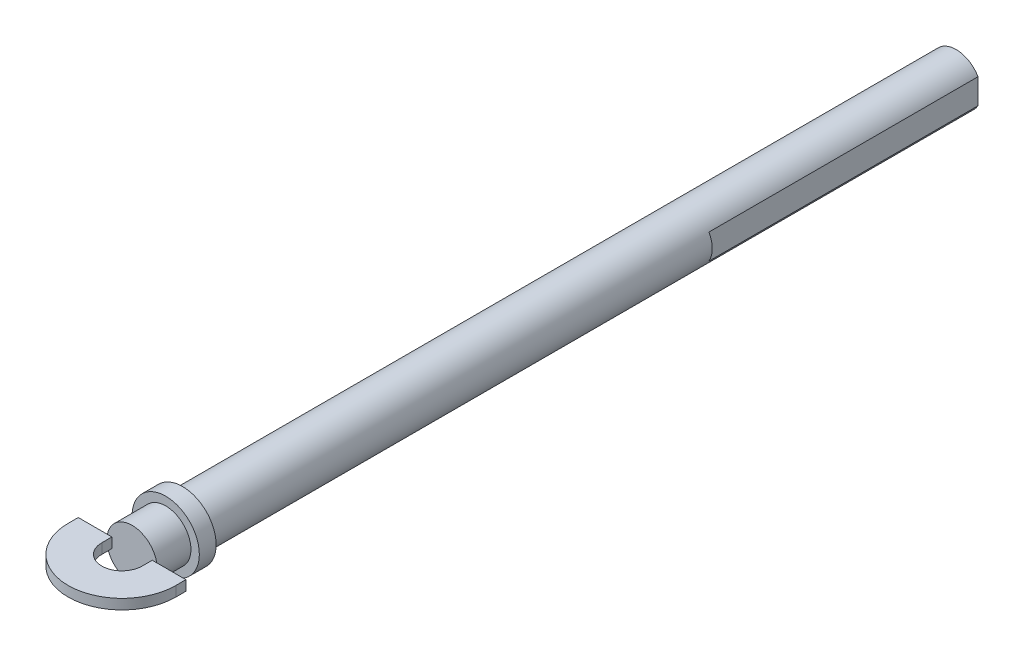
ISO-10303-21;
HEADER;
FILE_DESCRIPTION(('STEP AP214'),'2;1');
FILE_NAME('part.step','',(''),(''),'','','');
FILE_SCHEMA(('AUTOMOTIVE_DESIGN { 1 0 10303 214 1 1 1 1 }'));
ENDSEC;
DATA;
#1=APPLICATION_CONTEXT('core data for automotive mechanical design processes');
#2=APPLICATION_PROTOCOL_DEFINITION('international standard','automotive_design',2000,#1);
#3=PRODUCT_CONTEXT('',#1,'mechanical');
#4=PRODUCT('Part','Part','',(#3));
#5=PRODUCT_RELATED_PRODUCT_CATEGORY('part','',(#4));
#6=PRODUCT_DEFINITION_FORMATION('','',#4);
#7=PRODUCT_DEFINITION_CONTEXT('part definition',#1,'design');
#8=PRODUCT_DEFINITION('design','',#6,#7);
#9=PRODUCT_DEFINITION_SHAPE('','',#8);
#10=(LENGTH_UNIT() NAMED_UNIT(*) SI_UNIT(.MILLI.,.METRE.));
#11=(NAMED_UNIT(*) PLANE_ANGLE_UNIT() SI_UNIT($,.RADIAN.));
#12=(NAMED_UNIT(*) SI_UNIT($,.STERADIAN.) SOLID_ANGLE_UNIT());
#13=UNCERTAINTY_MEASURE_WITH_UNIT(LENGTH_MEASURE(1.E-05),#10,'distance_accuracy_value','');
#14=(GEOMETRIC_REPRESENTATION_CONTEXT(3) GLOBAL_UNCERTAINTY_ASSIGNED_CONTEXT((#13)) GLOBAL_UNIT_ASSIGNED_CONTEXT((#10,
#11,#12)) REPRESENTATION_CONTEXT('',''));
#15=CARTESIAN_POINT('',(0.,0.,0.));
#16=DIRECTION('',(0.,0.,1.));
#17=DIRECTION('',(1.,0.,0.));
#18=AXIS2_PLACEMENT_3D('',#15,#16,#17);
#19=CARTESIAN_POINT('',(0.,0.,230.));
#20=DIRECTION('',(0.,0.,-1.));
#21=DIRECTION('',(-1.,0.,0.));
#22=AXIS2_PLACEMENT_3D('',#19,#20,#21);
#23=CYLINDRICAL_SURFACE('',#22,7.5);
#24=CARTESIAN_POINT('',(0.,0.,230.));
#25=DIRECTION('',(0.,0.,1.));
#26=DIRECTION('',(1.,0.,0.));
#27=AXIS2_PLACEMENT_3D('',#24,#25,#26);
#28=CIRCLE('',#27,7.5);
#29=CARTESIAN_POINT('',(7.5,0.,230.));
#30=VERTEX_POINT('',#29);
#31=EDGE_CURVE('E197',#30,#30,#28,.T.);
#32=ORIENTED_EDGE('',*,*,#31,.F.);
#33=EDGE_LOOP('',(#32));
#34=FACE_BOUND('',#33,.T.);
#35=CARTESIAN_POINT('',(0.,0.,80.));
#36=DIRECTION('',(0.,0.,-1.));
#37=DIRECTION('',(-1.,0.,0.));
#38=AXIS2_PLACEMENT_3D('',#35,#36,#37);
#39=CIRCLE('',#38,7.5);
#40=CARTESIAN_POINT('',(6.5,3.74165738677394,80.));
#41=VERTEX_POINT('',#40);
#42=CARTESIAN_POINT('',(6.5,-3.74165738677394,80.));
#43=VERTEX_POINT('',#42);
#44=EDGE_CURVE('E168',#41,#43,#39,.T.);
#45=ORIENTED_EDGE('',*,*,#44,.F.);
#46=DIRECTION('',(0.,0.,-1.));
#47=VECTOR('',#46,1.);
#48=CARTESIAN_POINT('',(6.5,3.74165738677394,80.));
#49=LINE('',#48,#47);
#50=CARTESIAN_POINT('',(6.5,3.74165738677394,0.));
#51=VERTEX_POINT('',#50);
#52=EDGE_CURVE('E177',#41,#51,#49,.T.);
#53=ORIENTED_EDGE('',*,*,#52,.T.);
#54=CARTESIAN_POINT('',(0.,0.,0.));
#55=DIRECTION('',(0.,0.,1.));
#56=DIRECTION('',(1.,0.,0.));
#57=AXIS2_PLACEMENT_3D('',#54,#55,#56);
#58=CIRCLE('',#57,7.5);
#59=CARTESIAN_POINT('',(-6.5,3.74165738677394,0.));
#60=VERTEX_POINT('',#59);
#61=EDGE_CURVE('E206',#51,#60,#58,.T.);
#62=ORIENTED_EDGE('',*,*,#61,.T.);
#63=DIRECTION('',(0.,0.,-1.));
#64=VECTOR('',#63,1.);
#65=CARTESIAN_POINT('',(-6.5,3.74165738677394,80.));
#66=LINE('',#65,#64);
#67=CARTESIAN_POINT('',(-6.5,3.74165738677394,80.));
#68=VERTEX_POINT('',#67);
#69=EDGE_CURVE('E184',#68,#60,#66,.T.);
#70=ORIENTED_EDGE('',*,*,#69,.F.);
#71=CARTESIAN_POINT('',(0.,0.,80.));
#72=DIRECTION('',(0.,0.,-1.));
#73=DIRECTION('',(-1.,0.,0.));
#74=AXIS2_PLACEMENT_3D('',#71,#72,#73);
#75=CIRCLE('',#74,7.5);
#76=CARTESIAN_POINT('',(-6.5,-3.74165738677394,80.));
#77=VERTEX_POINT('',#76);
#78=EDGE_CURVE('E162',#77,#68,#75,.T.);
#79=ORIENTED_EDGE('',*,*,#78,.F.);
#80=DIRECTION('',(0.,0.,-1.));
#81=VECTOR('',#80,1.);
#82=CARTESIAN_POINT('',(-6.5,-3.74165738677394,80.));
#83=LINE('',#82,#81);
#84=CARTESIAN_POINT('',(-6.5,-3.74165738677394,0.));
#85=VERTEX_POINT('',#84);
#86=EDGE_CURVE('E176',#77,#85,#83,.T.);
#87=ORIENTED_EDGE('',*,*,#86,.T.);
#88=CARTESIAN_POINT('',(6.5,-3.74165738677394,0.));
#89=VERTEX_POINT('',#88);
#90=EDGE_CURVE('E201',#85,#89,#58,.T.);
#91=ORIENTED_EDGE('',*,*,#90,.T.);
#92=DIRECTION('',(0.,0.,-1.));
#93=VECTOR('',#92,1.);
#94=CARTESIAN_POINT('',(6.5,-3.74165738677394,80.));
#95=LINE('',#94,#93);
#96=EDGE_CURVE('E174',#43,#89,#95,.T.);
#97=ORIENTED_EDGE('',*,*,#96,.F.);
#98=EDGE_LOOP('',(#45,#53,#62,#70,#79,#87,#91,#97));
#99=FACE_BOUND('',#98,.T.);
#100=ADVANCED_FACE('F33',(#34,#99),#23,.T.);
#101=CARTESIAN_POINT('',(0.,0.,0.));
#102=DIRECTION('',(0.,0.,1.));
#103=DIRECTION('',(1.,0.,0.));
#104=AXIS2_PLACEMENT_3D('',#101,#102,#103);
#105=PLANE('',#104);
#106=ORIENTED_EDGE('',*,*,#61,.F.);
#107=DIRECTION('',(0.,1.,0.));
#108=VECTOR('',#107,1.);
#109=CARTESIAN_POINT('',(6.5,3.74165738677394,0.));
#110=LINE('',#109,#108);
#111=EDGE_CURVE('E171',#89,#51,#110,.T.);
#112=ORIENTED_EDGE('',*,*,#111,.F.);
#113=ORIENTED_EDGE('',*,*,#90,.F.);
#114=DIRECTION('',(0.,-1.,0.));
#115=VECTOR('',#114,1.);
#116=CARTESIAN_POINT('',(-6.5,3.74165738677394,0.));
#117=LINE('',#116,#115);
#118=EDGE_CURVE('E159',#60,#85,#117,.T.);
#119=ORIENTED_EDGE('',*,*,#118,.F.);
#120=EDGE_LOOP('',(#106,#112,#113,#119));
#121=FACE_BOUND('',#120,.T.);
#122=ADVANCED_FACE('F294',(#121),#105,.F.);
#123=CARTESIAN_POINT('',(0.,0.,235.));
#124=DIRECTION('',(0.,0.,-1.));
#125=DIRECTION('',(-1.,0.,0.));
#126=AXIS2_PLACEMENT_3D('',#123,#124,#125);
#127=CYLINDRICAL_SURFACE('',#126,10.);
#128=CARTESIAN_POINT('',(0.,0.,235.));
#129=DIRECTION('',(0.,0.,1.));
#130=DIRECTION('',(1.,0.,0.));
#131=AXIS2_PLACEMENT_3D('',#128,#129,#130);
#132=CIRCLE('',#131,10.);
#133=CARTESIAN_POINT('',(10.,0.,235.));
#134=VERTEX_POINT('',#133);
#135=EDGE_CURVE('E198',#134,#134,#132,.T.);
#136=ORIENTED_EDGE('',*,*,#135,.F.);
#137=EDGE_LOOP('',(#136));
#138=FACE_BOUND('',#137,.T.);
#139=CARTESIAN_POINT('',(0.,0.,230.));
#140=DIRECTION('',(0.,0.,1.));
#141=DIRECTION('',(1.,0.,0.));
#142=AXIS2_PLACEMENT_3D('',#139,#140,#141);
#143=CIRCLE('',#142,10.);
#144=CARTESIAN_POINT('',(10.,0.,230.));
#145=VERTEX_POINT('',#144);
#146=EDGE_CURVE('E192',#145,#145,#143,.T.);
#147=ORIENTED_EDGE('',*,*,#146,.T.);
#148=EDGE_LOOP('',(#147));
#149=FACE_BOUND('',#148,.T.);
#150=ADVANCED_FACE('F299',(#138,#149),#127,.T.);
#151=CARTESIAN_POINT('',(0.,0.,235.));
#152=DIRECTION('',(0.,0.,1.));
#153=DIRECTION('',(1.,0.,0.));
#154=AXIS2_PLACEMENT_3D('',#151,#152,#153);
#155=PLANE('',#154);
#156=CARTESIAN_POINT('',(0.,0.,235.));
#157=DIRECTION('',(0.,0.,1.));
#158=DIRECTION('',(1.,0.,0.));
#159=AXIS2_PLACEMENT_3D('',#156,#157,#158);
#160=CIRCLE('',#159,7.5);
#161=CARTESIAN_POINT('',(7.5,0.,235.));
#162=VERTEX_POINT('',#161);
#163=EDGE_CURVE('E194',#162,#162,#160,.T.);
#164=ORIENTED_EDGE('',*,*,#163,.F.);
#165=EDGE_LOOP('',(#164));
#166=FACE_BOUND('',#165,.T.);
#167=ORIENTED_EDGE('',*,*,#135,.T.);
#168=EDGE_LOOP('',(#167));
#169=FACE_BOUND('',#168,.T.);
#170=ADVANCED_FACE('F337',(#166,#169),#155,.T.);
#171=CARTESIAN_POINT('',(0.,0.,230.));
#172=DIRECTION('',(0.,0.,1.));
#173=DIRECTION('',(1.,0.,0.));
#174=AXIS2_PLACEMENT_3D('',#171,#172,#173);
#175=PLANE('',#174);
#176=ORIENTED_EDGE('',*,*,#31,.T.);
#177=EDGE_LOOP('',(#176));
#178=FACE_BOUND('',#177,.T.);
#179=ORIENTED_EDGE('',*,*,#146,.F.);
#180=EDGE_LOOP('',(#179));
#181=FACE_BOUND('',#180,.T.);
#182=ADVANCED_FACE('F336',(#178,#181),#175,.F.);
#183=CARTESIAN_POINT('',(0.,0.,245.));
#184=DIRECTION('',(0.,0.,-1.));
#185=DIRECTION('',(-1.,0.,0.));
#186=AXIS2_PLACEMENT_3D('',#183,#184,#185);
#187=CYLINDRICAL_SURFACE('',#186,7.5);
#188=CARTESIAN_POINT('',(0.,0.,245.));
#189=DIRECTION('',(0.,0.,1.));
#190=DIRECTION('',(1.,0.,0.));
#191=AXIS2_PLACEMENT_3D('',#188,#189,#190);
#192=CIRCLE('',#191,7.5);
#193=CARTESIAN_POINT('',(7.34846922834953,1.5,245.));
#194=VERTEX_POINT('',#193);
#195=CARTESIAN_POINT('',(-7.34846922834953,1.5,245.));
#196=VERTEX_POINT('',#195);
#197=EDGE_CURVE('E189',#194,#196,#192,.T.);
#198=ORIENTED_EDGE('',*,*,#197,.F.);
#199=CARTESIAN_POINT('',(7.34846922834953,-1.5,245.));
#200=VERTEX_POINT('',#199);
#201=EDGE_CURVE('E141',#200,#194,#192,.T.);
#202=ORIENTED_EDGE('',*,*,#201,.F.);
#203=CARTESIAN_POINT('',(-7.34846922834953,-1.5,245.));
#204=VERTEX_POINT('',#203);
#205=EDGE_CURVE('E215',#204,#200,#192,.T.);
#206=ORIENTED_EDGE('',*,*,#205,.F.);
#207=EDGE_CURVE('E193',#196,#204,#192,.T.);
#208=ORIENTED_EDGE('',*,*,#207,.F.);
#209=EDGE_LOOP('',(#198,#202,#206,#208));
#210=FACE_BOUND('',#209,.T.);
#211=ORIENTED_EDGE('',*,*,#163,.T.);
#212=EDGE_LOOP('',(#211));
#213=FACE_BOUND('',#212,.T.);
#214=ADVANCED_FACE('F223',(#210,#213),#187,.T.);
#215=CARTESIAN_POINT('',(0.,0.,245.));
#216=DIRECTION('',(0.,0.,1.));
#217=DIRECTION('',(1.,0.,0.));
#218=AXIS2_PLACEMENT_3D('',#215,#216,#217);
#219=PLANE('',#218);
#220=DIRECTION('',(1.,0.,0.));
#221=VECTOR('',#220,1.);
#222=CARTESIAN_POINT('',(6.,1.5,245.));
#223=LINE('',#222,#221);
#224=CARTESIAN_POINT('',(6.,1.5,245.));
#225=VERTEX_POINT('',#224);
#226=EDGE_CURVE('E144',#225,#194,#223,.T.);
#227=ORIENTED_EDGE('',*,*,#226,.T.);
#228=ORIENTED_EDGE('',*,*,#197,.T.);
#229=DIRECTION('',(-1.,0.,0.));
#230=VECTOR('',#229,1.);
#231=CARTESIAN_POINT('',(0.,1.5,245.));
#232=LINE('',#231,#230);
#233=CARTESIAN_POINT('',(-6.,1.5,245.));
#234=VERTEX_POINT('',#233);
#235=EDGE_CURVE('E11',#234,#196,#232,.T.);
#236=ORIENTED_EDGE('',*,*,#235,.F.);
#237=DIRECTION('',(0.,-1.,0.));
#238=VECTOR('',#237,1.);
#239=CARTESIAN_POINT('',(-6.,1.5,245.));
#240=LINE('',#239,#238);
#241=CARTESIAN_POINT('',(-6.,-1.5,245.));
#242=VERTEX_POINT('',#241);
#243=EDGE_CURVE('E217',#234,#242,#240,.T.);
#244=ORIENTED_EDGE('',*,*,#243,.T.);
#245=DIRECTION('',(-1.,0.,0.));
#246=VECTOR('',#245,1.);
#247=CARTESIAN_POINT('',(0.,-1.5,245.));
#248=LINE('',#247,#246);
#249=EDGE_CURVE('E40',#242,#204,#248,.T.);
#250=ORIENTED_EDGE('',*,*,#249,.T.);
#251=ORIENTED_EDGE('',*,*,#205,.T.);
#252=DIRECTION('',(1.,0.,0.));
#253=VECTOR('',#252,1.);
#254=CARTESIAN_POINT('',(6.,-1.5,245.));
#255=LINE('',#254,#253);
#256=CARTESIAN_POINT('',(6.,-1.5,245.));
#257=VERTEX_POINT('',#256);
#258=EDGE_CURVE('E245',#257,#200,#255,.T.);
#259=ORIENTED_EDGE('',*,*,#258,.F.);
#260=DIRECTION('',(0.,-1.,0.));
#261=VECTOR('',#260,1.);
#262=CARTESIAN_POINT('',(6.,1.5,245.));
#263=LINE('',#262,#261);
#264=EDGE_CURVE('E160',#225,#257,#263,.T.);
#265=ORIENTED_EDGE('',*,*,#264,.F.);
#266=EDGE_LOOP('',(#227,#228,#236,#244,#250,#251,#259,#265));
#267=FACE_BOUND('',#266,.T.);
#268=ADVANCED_FACE('F213',(#267),#219,.T.);
#269=CARTESIAN_POINT('',(-6.5,3.74165738677394,80.));
#270=DIRECTION('',(1.,0.,0.));
#271=DIRECTION('',(0.,0.,-1.));
#272=AXIS2_PLACEMENT_3D('',#269,#270,#271);
#273=PLANE('',#272);
#274=ORIENTED_EDGE('',*,*,#118,.T.);
#275=ORIENTED_EDGE('',*,*,#86,.F.);
#276=DIRECTION('',(0.,-1.,0.));
#277=VECTOR('',#276,1.);
#278=CARTESIAN_POINT('',(-6.5,3.74165738677394,80.));
#279=LINE('',#278,#277);
#280=EDGE_CURVE('E182',#68,#77,#279,.T.);
#281=ORIENTED_EDGE('',*,*,#280,.F.);
#282=ORIENTED_EDGE('',*,*,#69,.T.);
#283=EDGE_LOOP('',(#274,#275,#281,#282));
#284=FACE_BOUND('',#283,.T.);
#285=ADVANCED_FACE('F319',(#284),#273,.F.);
#286=CARTESIAN_POINT('',(0.,0.,80.));
#287=DIRECTION('',(0.,0.,-1.));
#288=DIRECTION('',(-1.,0.,0.));
#289=AXIS2_PLACEMENT_3D('',#286,#287,#288);
#290=PLANE('',#289);
#291=ORIENTED_EDGE('',*,*,#78,.T.);
#292=ORIENTED_EDGE('',*,*,#280,.T.);
#293=EDGE_LOOP('',(#291,#292));
#294=FACE_BOUND('',#293,.T.);
#295=ADVANCED_FACE('F321',(#294),#290,.T.);
#296=CARTESIAN_POINT('',(6.5,3.74165738677394,80.));
#297=DIRECTION('',(-1.,0.,0.));
#298=DIRECTION('',(0.,0.,1.));
#299=AXIS2_PLACEMENT_3D('',#296,#297,#298);
#300=PLANE('',#299);
#301=ORIENTED_EDGE('',*,*,#111,.T.);
#302=ORIENTED_EDGE('',*,*,#52,.F.);
#303=DIRECTION('',(0.,1.,0.));
#304=VECTOR('',#303,1.);
#305=CARTESIAN_POINT('',(6.5,3.74165738677394,80.));
#306=LINE('',#305,#304);
#307=EDGE_CURVE('E170',#43,#41,#306,.T.);
#308=ORIENTED_EDGE('',*,*,#307,.F.);
#309=ORIENTED_EDGE('',*,*,#96,.T.);
#310=EDGE_LOOP('',(#301,#302,#308,#309));
#311=FACE_BOUND('',#310,.T.);
#312=ADVANCED_FACE('F311',(#311),#300,.F.);
#313=CARTESIAN_POINT('',(0.,0.,80.));
#314=DIRECTION('',(0.,0.,-1.));
#315=DIRECTION('',(-1.,0.,0.));
#316=AXIS2_PLACEMENT_3D('',#313,#314,#315);
#317=PLANE('',#316);
#318=ORIENTED_EDGE('',*,*,#44,.T.);
#319=ORIENTED_EDGE('',*,*,#307,.T.);
#320=EDGE_LOOP('',(#318,#319));
#321=FACE_BOUND('',#320,.T.);
#322=ADVANCED_FACE('F309',(#321),#317,.T.);
#323=CARTESIAN_POINT('',(16.,1.5,248.));
#324=DIRECTION('',(-1.,0.,0.));
#325=DIRECTION('',(0.,0.,1.));
#326=AXIS2_PLACEMENT_3D('',#323,#324,#325);
#327=PLANE('',#326);
#328=DIRECTION('',(0.,0.,-1.));
#329=VECTOR('',#328,1.);
#330=CARTESIAN_POINT('',(16.,-1.5,248.));
#331=LINE('',#330,#329);
#332=CARTESIAN_POINT('',(16.,-1.5,248.));
#333=VERTEX_POINT('',#332);
#334=CARTESIAN_POINT('',(16.,-1.5,245.));
#335=VERTEX_POINT('',#334);
#336=EDGE_CURVE('E158',#333,#335,#331,.T.);
#337=ORIENTED_EDGE('',*,*,#336,.T.);
#338=DIRECTION('',(0.,-1.,0.));
#339=VECTOR('',#338,1.);
#340=CARTESIAN_POINT('',(16.,1.5,245.));
#341=LINE('',#340,#339);
#342=CARTESIAN_POINT('',(16.,1.5,245.));
#343=VERTEX_POINT('',#342);
#344=EDGE_CURVE('E138',#343,#335,#341,.T.);
#345=ORIENTED_EDGE('',*,*,#344,.F.);
#346=DIRECTION('',(0.,0.,-1.));
#347=VECTOR('',#346,1.);
#348=CARTESIAN_POINT('',(16.,1.5,248.));
#349=LINE('',#348,#347);
#350=CARTESIAN_POINT('',(16.,1.5,248.));
#351=VERTEX_POINT('',#350);
#352=EDGE_CURVE('E145',#351,#343,#349,.T.);
#353=ORIENTED_EDGE('',*,*,#352,.F.);
#354=DIRECTION('',(0.,-1.,0.));
#355=VECTOR('',#354,1.);
#356=CARTESIAN_POINT('',(16.,1.5,248.));
#357=LINE('',#356,#355);
#358=EDGE_CURVE('E242',#351,#333,#357,.T.);
#359=ORIENTED_EDGE('',*,*,#358,.T.);
#360=EDGE_LOOP('',(#337,#345,#353,#359));
#361=FACE_BOUND('',#360,.T.);
#362=ADVANCED_FACE('F156',(#361),#327,.F.);
#363=CARTESIAN_POINT('',(6.,1.5,245.));
#364=DIRECTION('',(0.,0.,-1.));
#365=DIRECTION('',(-1.,0.,0.));
#366=AXIS2_PLACEMENT_3D('',#363,#364,#365);
#367=PLANE('',#366);
#368=ORIENTED_EDGE('',*,*,#201,.T.);
#369=EDGE_CURVE('E134',#194,#343,#223,.T.);
#370=ORIENTED_EDGE('',*,*,#369,.T.);
#371=ORIENTED_EDGE('',*,*,#344,.T.);
#372=EDGE_CURVE('E244',#200,#335,#255,.T.);
#373=ORIENTED_EDGE('',*,*,#372,.F.);
#374=EDGE_LOOP('',(#368,#370,#371,#373));
#375=FACE_BOUND('',#374,.T.);
#376=ADVANCED_FACE('F136',(#375),#367,.T.);
#377=CARTESIAN_POINT('',(6.,1.5,248.));
#378=DIRECTION('',(-1.,0.,0.));
#379=DIRECTION('',(0.,0.,1.));
#380=AXIS2_PLACEMENT_3D('',#377,#378,#379);
#381=PLANE('',#380);
#382=DIRECTION('',(0.,0.,-1.));
#383=VECTOR('',#382,1.);
#384=CARTESIAN_POINT('',(6.,-1.5,248.));
#385=LINE('',#384,#383);
#386=CARTESIAN_POINT('',(6.,-1.5,248.));
#387=VERTEX_POINT('',#386);
#388=EDGE_CURVE('E47',#387,#257,#385,.T.);
#389=ORIENTED_EDGE('',*,*,#388,.F.);
#390=DIRECTION('',(0.,-1.,0.));
#391=VECTOR('',#390,1.);
#392=CARTESIAN_POINT('',(6.,1.5,248.));
#393=LINE('',#392,#391);
#394=CARTESIAN_POINT('',(6.,1.5,248.));
#395=VERTEX_POINT('',#394);
#396=EDGE_CURVE('E164',#395,#387,#393,.T.);
#397=ORIENTED_EDGE('',*,*,#396,.F.);
#398=DIRECTION('',(0.,0.,-1.));
#399=VECTOR('',#398,1.);
#400=CARTESIAN_POINT('',(6.,1.5,248.));
#401=LINE('',#400,#399);
#402=EDGE_CURVE('E277',#395,#225,#401,.T.);
#403=ORIENTED_EDGE('',*,*,#402,.T.);
#404=ORIENTED_EDGE('',*,*,#264,.T.);
#405=EDGE_LOOP('',(#389,#397,#403,#404));
#406=FACE_BOUND('',#405,.T.);
#407=ADVANCED_FACE('F271',(#406),#381,.T.);
#408=CARTESIAN_POINT('',(0.,1.5,248.));
#409=DIRECTION('',(0.,-1.,0.));
#410=DIRECTION('',(0.,0.,-1.));
#411=AXIS2_PLACEMENT_3D('',#408,#409,#410);
#412=CYLINDRICAL_SURFACE('',#411,6.);
#413=CARTESIAN_POINT('',(0.,-1.5,248.));
#414=DIRECTION('',(0.,1.,0.));
#415=DIRECTION('',(0.,0.,1.));
#416=AXIS2_PLACEMENT_3D('',#413,#414,#415);
#417=CIRCLE('',#416,6.);
#418=CARTESIAN_POINT('',(-6.,-1.5,248.));
#419=VERTEX_POINT('',#418);
#420=EDGE_CURVE('E248',#419,#387,#417,.T.);
#421=ORIENTED_EDGE('',*,*,#420,.F.);
#422=DIRECTION('',(0.,-1.,0.));
#423=VECTOR('',#422,1.);
#424=CARTESIAN_POINT('',(-6.,1.5,248.));
#425=LINE('',#424,#423);
#426=CARTESIAN_POINT('',(-6.,1.5,248.));
#427=VERTEX_POINT('',#426);
#428=EDGE_CURVE('E262',#427,#419,#425,.T.);
#429=ORIENTED_EDGE('',*,*,#428,.F.);
#430=CARTESIAN_POINT('',(0.,1.5,248.));
#431=DIRECTION('',(0.,1.,0.));
#432=DIRECTION('',(0.,0.,1.));
#433=AXIS2_PLACEMENT_3D('',#430,#431,#432);
#434=CIRCLE('',#433,6.);
#435=EDGE_CURVE('E237',#427,#395,#434,.T.);
#436=ORIENTED_EDGE('',*,*,#435,.T.);
#437=ORIENTED_EDGE('',*,*,#396,.T.);
#438=EDGE_LOOP('',(#421,#429,#436,#437));
#439=FACE_BOUND('',#438,.T.);
#440=ADVANCED_FACE('F266',(#439),#412,.F.);
#441=CARTESIAN_POINT('',(-6.,1.5,245.));
#442=DIRECTION('',(1.,0.,0.));
#443=DIRECTION('',(0.,0.,-1.));
#444=AXIS2_PLACEMENT_3D('',#441,#442,#443);
#445=PLANE('',#444);
#446=DIRECTION('',(0.,0.,1.));
#447=VECTOR('',#446,1.);
#448=CARTESIAN_POINT('',(-6.,-1.5,245.));
#449=LINE('',#448,#447);
#450=EDGE_CURVE('E250',#242,#419,#449,.T.);
#451=ORIENTED_EDGE('',*,*,#450,.F.);
#452=ORIENTED_EDGE('',*,*,#243,.F.);
#453=DIRECTION('',(0.,0.,1.));
#454=VECTOR('',#453,1.);
#455=CARTESIAN_POINT('',(-6.,1.5,245.));
#456=LINE('',#455,#454);
#457=EDGE_CURVE('E233',#234,#427,#456,.T.);
#458=ORIENTED_EDGE('',*,*,#457,.T.);
#459=ORIENTED_EDGE('',*,*,#428,.T.);
#460=EDGE_LOOP('',(#451,#452,#458,#459));
#461=FACE_BOUND('',#460,.T.);
#462=ADVANCED_FACE('F275',(#461),#445,.T.);
#463=CARTESIAN_POINT('',(-16.,1.5,245.));
#464=DIRECTION('',(0.,0.,-1.));
#465=DIRECTION('',(-1.,0.,0.));
#466=AXIS2_PLACEMENT_3D('',#463,#464,#465);
#467=PLANE('',#466);
#468=ORIENTED_EDGE('',*,*,#207,.T.);
#469=DIRECTION('',(1.,0.,0.));
#470=VECTOR('',#469,1.);
#471=CARTESIAN_POINT('',(-16.,-1.5,245.));
#472=LINE('',#471,#470);
#473=CARTESIAN_POINT('',(-16.,-1.5,245.));
#474=VERTEX_POINT('',#473);
#475=EDGE_CURVE('E54',#474,#204,#472,.T.);
#476=ORIENTED_EDGE('',*,*,#475,.F.);
#477=DIRECTION('',(0.,-1.,0.));
#478=VECTOR('',#477,1.);
#479=CARTESIAN_POINT('',(-16.,1.5,245.));
#480=LINE('',#479,#478);
#481=CARTESIAN_POINT('',(-16.,1.5,245.));
#482=VERTEX_POINT('',#481);
#483=EDGE_CURVE('E230',#482,#474,#480,.T.);
#484=ORIENTED_EDGE('',*,*,#483,.F.);
#485=DIRECTION('',(1.,0.,0.));
#486=VECTOR('',#485,1.);
#487=CARTESIAN_POINT('',(-16.,1.5,245.));
#488=LINE('',#487,#486);
#489=EDGE_CURVE('E229',#482,#196,#488,.T.);
#490=ORIENTED_EDGE('',*,*,#489,.T.);
#491=EDGE_LOOP('',(#468,#476,#484,#490));
#492=FACE_BOUND('',#491,.T.);
#493=ADVANCED_FACE('F227',(#492),#467,.T.);
#494=CARTESIAN_POINT('',(-16.,1.5,245.));
#495=DIRECTION('',(1.,0.,0.));
#496=DIRECTION('',(0.,0.,-1.));
#497=AXIS2_PLACEMENT_3D('',#494,#495,#496);
#498=PLANE('',#497);
#499=DIRECTION('',(0.,0.,-1.));
#500=VECTOR('',#499,1.);
#501=CARTESIAN_POINT('',(-16.,-1.5,245.));
#502=LINE('',#501,#500);
#503=CARTESIAN_POINT('',(-16.,-1.5,248.));
#504=VERTEX_POINT('',#503);
#505=EDGE_CURVE('E253',#474,#504,#502,.F.);
#506=ORIENTED_EDGE('',*,*,#505,.T.);
#507=DIRECTION('',(0.,-1.,0.));
#508=VECTOR('',#507,1.);
#509=CARTESIAN_POINT('',(-16.,1.5,248.));
#510=LINE('',#509,#508);
#511=CARTESIAN_POINT('',(-16.,1.5,248.));
#512=VERTEX_POINT('',#511);
#513=EDGE_CURVE('E257',#512,#504,#510,.T.);
#514=ORIENTED_EDGE('',*,*,#513,.F.);
#515=DIRECTION('',(0.,0.,-1.));
#516=VECTOR('',#515,1.);
#517=CARTESIAN_POINT('',(-16.,1.5,245.));
#518=LINE('',#517,#516);
#519=EDGE_CURVE('E232',#482,#512,#518,.F.);
#520=ORIENTED_EDGE('',*,*,#519,.F.);
#521=ORIENTED_EDGE('',*,*,#483,.T.);
#522=EDGE_LOOP('',(#506,#514,#520,#521));
#523=FACE_BOUND('',#522,.T.);
#524=ADVANCED_FACE('F284',(#523),#498,.F.);
#525=CARTESIAN_POINT('',(0.,1.5,248.));
#526=DIRECTION('',(0.,-1.,0.));
#527=DIRECTION('',(0.,0.,-1.));
#528=AXIS2_PLACEMENT_3D('',#525,#526,#527);
#529=CYLINDRICAL_SURFACE('',#528,16.);
#530=CARTESIAN_POINT('',(0.,-1.5,248.));
#531=DIRECTION('',(0.,1.,0.));
#532=DIRECTION('',(1.,0.,0.));
#533=AXIS2_PLACEMENT_3D('',#530,#531,#532);
#534=CIRCLE('',#533,16.);
#535=EDGE_CURVE('E154',#504,#333,#534,.T.);
#536=ORIENTED_EDGE('',*,*,#535,.T.);
#537=ORIENTED_EDGE('',*,*,#358,.F.);
#538=CARTESIAN_POINT('',(0.,1.5,248.));
#539=DIRECTION('',(0.,1.,0.));
#540=DIRECTION('',(1.,0.,0.));
#541=AXIS2_PLACEMENT_3D('',#538,#539,#540);
#542=CIRCLE('',#541,16.);
#543=EDGE_CURVE('E150',#512,#351,#542,.T.);
#544=ORIENTED_EDGE('',*,*,#543,.F.);
#545=ORIENTED_EDGE('',*,*,#513,.T.);
#546=EDGE_LOOP('',(#536,#537,#544,#545));
#547=FACE_BOUND('',#546,.T.);
#548=ADVANCED_FACE('F281',(#547),#529,.T.);
#549=CARTESIAN_POINT('',(0.,1.5,248.));
#550=DIRECTION('',(0.,1.,0.));
#551=DIRECTION('',(1.,0.,0.));
#552=AXIS2_PLACEMENT_3D('',#549,#550,#551);
#553=PLANE('',#552);
#554=ORIENTED_EDGE('',*,*,#352,.T.);
#555=ORIENTED_EDGE('',*,*,#369,.F.);
#556=ORIENTED_EDGE('',*,*,#226,.F.);
#557=ORIENTED_EDGE('',*,*,#402,.F.);
#558=ORIENTED_EDGE('',*,*,#435,.F.);
#559=ORIENTED_EDGE('',*,*,#457,.F.);
#560=ORIENTED_EDGE('',*,*,#235,.T.);
#561=ORIENTED_EDGE('',*,*,#489,.F.);
#562=ORIENTED_EDGE('',*,*,#519,.T.);
#563=ORIENTED_EDGE('',*,*,#543,.T.);
#564=EDGE_LOOP('',(#554,#555,#556,#557,#558,#559,#560,#561,#562,#563));
#565=FACE_BOUND('',#564,.T.);
#566=ADVANCED_FACE('F148',(#565),#553,.T.);
#567=CARTESIAN_POINT('',(0.,-1.5,248.));
#568=DIRECTION('',(0.,1.,0.));
#569=DIRECTION('',(1.,0.,0.));
#570=AXIS2_PLACEMENT_3D('',#567,#568,#569);
#571=PLANE('',#570);
#572=ORIENTED_EDGE('',*,*,#336,.F.);
#573=ORIENTED_EDGE('',*,*,#535,.F.);
#574=ORIENTED_EDGE('',*,*,#505,.F.);
#575=ORIENTED_EDGE('',*,*,#475,.T.);
#576=ORIENTED_EDGE('',*,*,#249,.F.);
#577=ORIENTED_EDGE('',*,*,#450,.T.);
#578=ORIENTED_EDGE('',*,*,#420,.T.);
#579=ORIENTED_EDGE('',*,*,#388,.T.);
#580=ORIENTED_EDGE('',*,*,#258,.T.);
#581=ORIENTED_EDGE('',*,*,#372,.T.);
#582=EDGE_LOOP('',(#572,#573,#574,#575,#576,#577,#578,#579,#580,#581));
#583=FACE_BOUND('',#582,.T.);
#584=ADVANCED_FACE('F273',(#583),#571,.F.);
#585=CLOSED_SHELL('',(#100,#122,#150,#170,#182,#214,#268,#285,#295,#312,#322,#362,#376,#407,
#440,#462,#493,#524,#548,#566,#584));
#586=MANIFOLD_SOLID_BREP('B2',#585);
#587=ADVANCED_BREP_SHAPE_REPRESENTATION('',(#18,#586),#14);
#588=SHAPE_DEFINITION_REPRESENTATION(#9,#587);
ENDSEC;
END-ISO-10303-21;
